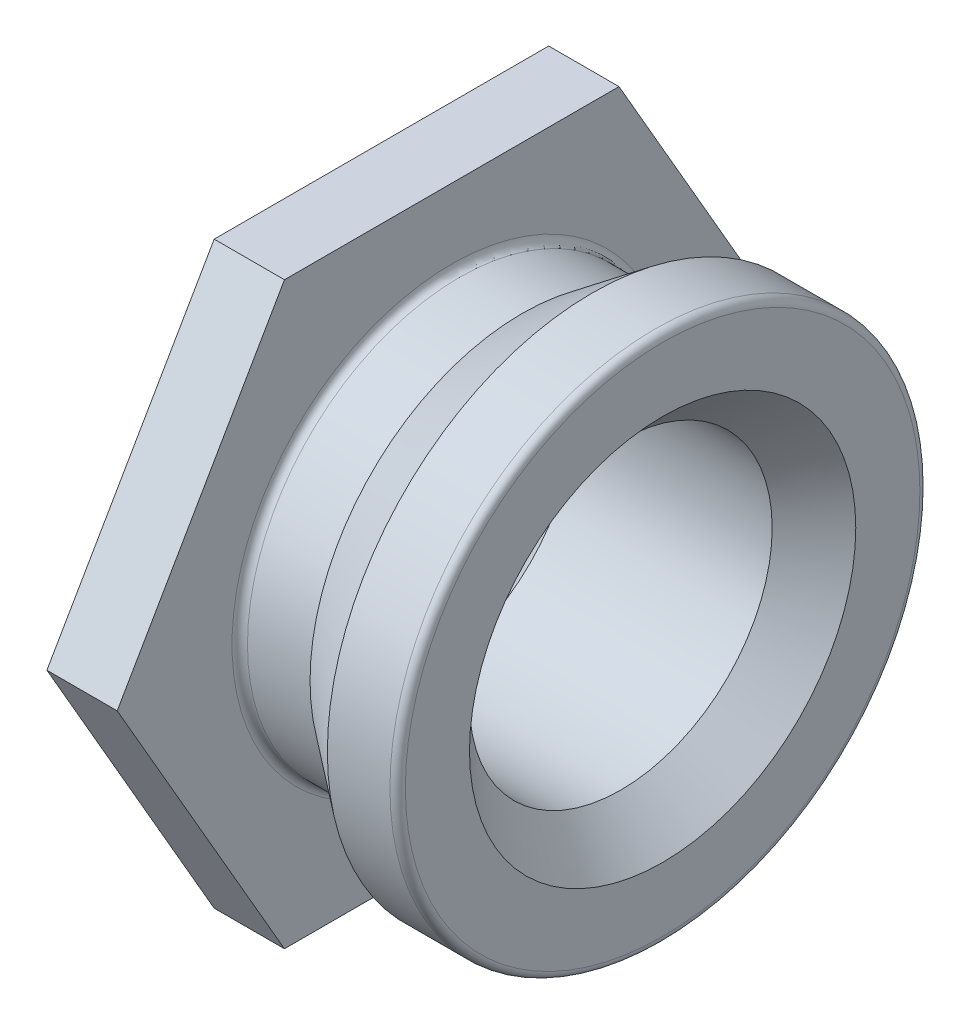
ISO-10303-21;
HEADER;
FILE_DESCRIPTION(('STEP AP214'),'2;1');
FILE_NAME('part.step','',(''),(''),'','','');
FILE_SCHEMA(('AUTOMOTIVE_DESIGN { 1 0 10303 214 1 1 1 1 }'));
ENDSEC;
DATA;
#1=APPLICATION_CONTEXT('core data for automotive mechanical design processes');
#2=APPLICATION_PROTOCOL_DEFINITION('international standard','automotive_design',2000,#1);
#3=PRODUCT_CONTEXT('',#1,'mechanical');
#4=PRODUCT('Part','Part','',(#3));
#5=PRODUCT_RELATED_PRODUCT_CATEGORY('part','',(#4));
#6=PRODUCT_DEFINITION_FORMATION('','',#4);
#7=PRODUCT_DEFINITION_CONTEXT('part definition',#1,'design');
#8=PRODUCT_DEFINITION('design','',#6,#7);
#9=PRODUCT_DEFINITION_SHAPE('','',#8);
#10=(LENGTH_UNIT() NAMED_UNIT(*) SI_UNIT(.MILLI.,.METRE.));
#11=(NAMED_UNIT(*) PLANE_ANGLE_UNIT() SI_UNIT($,.RADIAN.));
#12=(NAMED_UNIT(*) SI_UNIT($,.STERADIAN.) SOLID_ANGLE_UNIT());
#13=UNCERTAINTY_MEASURE_WITH_UNIT(LENGTH_MEASURE(1.E-05),#10,'distance_accuracy_value','');
#14=(GEOMETRIC_REPRESENTATION_CONTEXT(3) GLOBAL_UNCERTAINTY_ASSIGNED_CONTEXT((#13)) GLOBAL_UNIT_ASSIGNED_CONTEXT((#10,
#11,#12)) REPRESENTATION_CONTEXT('',''));
#15=CARTESIAN_POINT('',(0.,0.,0.));
#16=DIRECTION('',(0.,0.,1.));
#17=DIRECTION('',(1.,0.,0.));
#18=AXIS2_PLACEMENT_3D('',#15,#16,#17);
#19=CARTESIAN_POINT('',(-2.82575,0.,0.));
#20=DIRECTION('',(1.,0.,0.));
#21=DIRECTION('',(0.,0.,-1.));
#22=AXIS2_PLACEMENT_3D('',#19,#20,#21);
#23=CYLINDRICAL_SURFACE('',#22,3.48488);
#24=CARTESIAN_POINT('',(-3.3401,0.,0.));
#25=DIRECTION('',(1.,0.,0.));
#26=DIRECTION('',(0.,0.,-1.));
#27=AXIS2_PLACEMENT_3D('',#24,#25,#26);
#28=CIRCLE('',#27,3.48488);
#29=CARTESIAN_POINT('',(-3.3401,0.,-3.48488));
#30=VERTEX_POINT('',#29);
#31=EDGE_CURVE('E134',#30,#30,#28,.T.);
#32=ORIENTED_EDGE('',*,*,#31,.T.);
#33=EDGE_LOOP('',(#32));
#34=FACE_BOUND('',#33,.T.);
#35=CARTESIAN_POINT('',(-2.31140000033747,0.,0.));
#36=DIRECTION('',(1.,0.,0.));
#37=DIRECTION('',(0.,0.,1.));
#38=AXIS2_PLACEMENT_3D('',#35,#36,#37);
#39=CIRCLE('',#38,3.48488000042835);
#40=CARTESIAN_POINT('',(-2.31140000033747,0.,3.48488000042835));
#41=VERTEX_POINT('',#40);
#42=EDGE_CURVE('E152',#41,#41,#39,.T.);
#43=ORIENTED_EDGE('',*,*,#42,.F.);
#44=EDGE_LOOP('',(#43));
#45=FACE_BOUND('',#44,.T.);
#46=ADVANCED_FACE('F16',(#34,#45),#23,.T.);
#47=CARTESIAN_POINT('',(-1.15569999979925,0.,0.));
#48=DIRECTION('',(1.,0.,0.));
#49=DIRECTION('',(0.,0.,-1.));
#50=AXIS2_PLACEMENT_3D('',#47,#48,#49);
#51=CONICAL_SURFACE('',#50,4.35609999948383,0.645958105561131);
#52=ORIENTED_EDGE('',*,*,#42,.T.);
#53=EDGE_LOOP('',(#52));
#54=FACE_BOUND('',#53,.T.);
#55=CARTESIAN_POINT('',(-1.1557,0.,0.));
#56=DIRECTION('',(1.,0.,0.));
#57=DIRECTION('',(0.,0.,-1.));
#58=AXIS2_PLACEMENT_3D('',#55,#56,#57);
#59=CIRCLE('',#58,4.3561);
#60=CARTESIAN_POINT('',(-1.1557,0.,-4.3561));
#61=VERTEX_POINT('',#60);
#62=EDGE_CURVE('E126',#61,#61,#59,.T.);
#63=ORIENTED_EDGE('',*,*,#62,.F.);
#64=EDGE_LOOP('',(#63));
#65=FACE_BOUND('',#64,.T.);
#66=ADVANCED_FACE('F145',(#54,#65),#51,.T.);
#67=CARTESIAN_POINT('',(-3.3401,0.,0.));
#68=DIRECTION('',(1.,0.,0.));
#69=DIRECTION('',(0.,0.,-1.));
#70=AXIS2_PLACEMENT_3D('',#67,#68,#69);
#71=TOROIDAL_SURFACE('',#70,3.61188,0.126999999999999);
#72=CARTESIAN_POINT('',(-3.4671,0.,0.));
#73=DIRECTION('',(1.,0.,0.));
#74=DIRECTION('',(0.,0.,-1.));
#75=AXIS2_PLACEMENT_3D('',#72,#73,#74);
#76=CIRCLE('',#75,3.61188);
#77=CARTESIAN_POINT('',(-3.4671,0.,-3.61188));
#78=VERTEX_POINT('',#77);
#79=EDGE_CURVE('E122',#78,#78,#76,.F.);
#80=ORIENTED_EDGE('',*,*,#79,.F.);
#81=EDGE_LOOP('',(#80));
#82=FACE_BOUND('',#81,.T.);
#83=ORIENTED_EDGE('',*,*,#31,.F.);
#84=EDGE_LOOP('',(#83));
#85=FACE_BOUND('',#84,.T.);
#86=ADVANCED_FACE('F141',(#82,#85),#71,.F.);
#87=CARTESIAN_POINT('',(-0.64135,0.,0.));
#88=DIRECTION('',(1.,0.,0.));
#89=DIRECTION('',(0.,0.,-1.));
#90=AXIS2_PLACEMENT_3D('',#87,#88,#89);
#91=CYLINDRICAL_SURFACE('',#90,4.3561);
#92=ORIENTED_EDGE('',*,*,#62,.T.);
#93=EDGE_LOOP('',(#92));
#94=FACE_BOUND('',#93,.T.);
#95=CARTESIAN_POINT('',(-0.127,0.,0.));
#96=DIRECTION('',(1.,0.,0.));
#97=DIRECTION('',(0.,0.,-1.));
#98=AXIS2_PLACEMENT_3D('',#95,#96,#97);
#99=CIRCLE('',#98,4.3561);
#100=CARTESIAN_POINT('',(-0.127,0.,-4.3561));
#101=VERTEX_POINT('',#100);
#102=EDGE_CURVE('E82',#101,#101,#99,.T.);
#103=ORIENTED_EDGE('',*,*,#102,.F.);
#104=EDGE_LOOP('',(#103));
#105=FACE_BOUND('',#104,.T.);
#106=ADVANCED_FACE('F144',(#94,#105),#91,.T.);
#107=CARTESIAN_POINT('',(-3.4671,0.,0.));
#108=DIRECTION('',(1.,0.,0.));
#109=DIRECTION('',(0.,0.,-1.));
#110=AXIS2_PLACEMENT_3D('',#107,#108,#109);
#111=PLANE('',#110);
#112=ORIENTED_EDGE('',*,*,#79,.T.);
#113=EDGE_LOOP('',(#112));
#114=FACE_BOUND('',#113,.T.);
#115=DIRECTION('',(0.,0.866025403784438,-0.5));
#116=VECTOR('',#115,1.);
#117=CARTESIAN_POINT('',(-3.4671,0.,-5.49926131403119));
#118=LINE('',#117,#116);
#119=CARTESIAN_POINT('',(-3.4671,0.,-5.49926131403119));
#120=VERTEX_POINT('',#119);
#121=CARTESIAN_POINT('',(-3.4671,-4.7625,-2.74963065701559));
#122=VERTEX_POINT('',#121);
#123=EDGE_CURVE('E86',#120,#122,#118,.F.);
#124=ORIENTED_EDGE('',*,*,#123,.F.);
#125=DIRECTION('',(0.,0.866025403784439,0.5));
#126=VECTOR('',#125,1.);
#127=CARTESIAN_POINT('',(-3.4671,4.7625,-2.7496306570156));
#128=LINE('',#127,#126);
#129=CARTESIAN_POINT('',(-3.4671,4.7625,-2.7496306570156));
#130=VERTEX_POINT('',#129);
#131=EDGE_CURVE('E67',#130,#120,#128,.F.);
#132=ORIENTED_EDGE('',*,*,#131,.F.);
#133=DIRECTION('',(0.,0.,1.));
#134=VECTOR('',#133,1.);
#135=CARTESIAN_POINT('',(-3.4671,4.7625,0.));
#136=LINE('',#135,#134);
#137=CARTESIAN_POINT('',(-3.4671,4.7625,2.74963065701559));
#138=VERTEX_POINT('',#137);
#139=EDGE_CURVE('E74',#138,#130,#136,.F.);
#140=ORIENTED_EDGE('',*,*,#139,.F.);
#141=DIRECTION('',(0.,-0.866025403784439,0.5));
#142=VECTOR('',#141,1.);
#143=CARTESIAN_POINT('',(-3.4671,0.,5.49926131403118));
#144=LINE('',#143,#142);
#145=CARTESIAN_POINT('',(-3.4671,0.,5.49926131403118));
#146=VERTEX_POINT('',#145);
#147=EDGE_CURVE('E451',#146,#138,#144,.F.);
#148=ORIENTED_EDGE('',*,*,#147,.F.);
#149=DIRECTION('',(0.,-0.866025403784439,-0.5));
#150=VECTOR('',#149,1.);
#151=CARTESIAN_POINT('',(-3.4671,-4.7625,2.74963065701559));
#152=LINE('',#151,#150);
#153=CARTESIAN_POINT('',(-3.4671,-4.7625,2.74963065701559));
#154=VERTEX_POINT('',#153);
#155=EDGE_CURVE('E446',#154,#146,#152,.F.);
#156=ORIENTED_EDGE('',*,*,#155,.F.);
#157=DIRECTION('',(0.,0.,-1.));
#158=VECTOR('',#157,1.);
#159=CARTESIAN_POINT('',(-3.4671,-4.7625,-2.74963065701559));
#160=LINE('',#159,#158);
#161=EDGE_CURVE('E441',#122,#154,#160,.F.);
#162=ORIENTED_EDGE('',*,*,#161,.F.);
#163=EDGE_LOOP('',(#124,#132,#140,#148,#156,#162));
#164=FACE_BOUND('',#163,.T.);
#165=ADVANCED_FACE('F89',(#114,#164),#111,.T.);
#166=CARTESIAN_POINT('',(-0.127,0.,0.));
#167=DIRECTION('',(1.,0.,0.));
#168=DIRECTION('',(0.,0.,-1.));
#169=AXIS2_PLACEMENT_3D('',#166,#167,#168);
#170=TOROIDAL_SURFACE('',#169,4.2291,0.127);
#171=CARTESIAN_POINT('',(0.,0.,0.));
#172=DIRECTION('',(-1.,0.,0.));
#173=DIRECTION('',(0.,0.,1.));
#174=AXIS2_PLACEMENT_3D('',#171,#172,#173);
#175=CIRCLE('',#174,4.2291);
#176=CARTESIAN_POINT('',(0.,0.,4.2291));
#177=VERTEX_POINT('',#176);
#178=EDGE_CURVE('E184',#177,#177,#175,.F.);
#179=ORIENTED_EDGE('',*,*,#178,.F.);
#180=EDGE_LOOP('',(#179));
#181=FACE_BOUND('',#180,.T.);
#182=ORIENTED_EDGE('',*,*,#102,.T.);
#183=EDGE_LOOP('',(#182));
#184=FACE_BOUND('',#183,.T.);
#185=ADVANCED_FACE('F98',(#181,#184),#170,.T.);
#186=CARTESIAN_POINT('',(-4.6228,4.7625,0.));
#187=DIRECTION('',(0.,1.,0.));
#188=DIRECTION('',(0.,0.,1.));
#189=AXIS2_PLACEMENT_3D('',#186,#187,#188);
#190=PLANE('',#189);
#191=DIRECTION('',(0.,0.,1.));
#192=VECTOR('',#191,1.);
#193=CARTESIAN_POINT('',(-4.6228,4.7625,1.80594));
#194=LINE('',#193,#192);
#195=CARTESIAN_POINT('',(-4.6228,4.7625,2.74963065701559));
#196=VERTEX_POINT('',#195);
#197=CARTESIAN_POINT('',(-4.6228,4.7625,-2.7496306570156));
#198=VERTEX_POINT('',#197);
#199=EDGE_CURVE('E182',#196,#198,#194,.F.);
#200=ORIENTED_EDGE('',*,*,#199,.F.);
#201=DIRECTION('',(1.,0.,0.));
#202=VECTOR('',#201,1.);
#203=CARTESIAN_POINT('',(-4.6228,4.7625,2.74963065701559));
#204=LINE('',#203,#202);
#205=EDGE_CURVE('E79',#138,#196,#204,.F.);
#206=ORIENTED_EDGE('',*,*,#205,.F.);
#207=ORIENTED_EDGE('',*,*,#139,.T.);
#208=DIRECTION('',(1.,0.,0.));
#209=VECTOR('',#208,1.);
#210=CARTESIAN_POINT('',(-4.6228,4.7625,-2.7496306570156));
#211=LINE('',#210,#209);
#212=EDGE_CURVE('E77',#198,#130,#211,.T.);
#213=ORIENTED_EDGE('',*,*,#212,.F.);
#214=EDGE_LOOP('',(#200,#206,#207,#213));
#215=FACE_BOUND('',#214,.T.);
#216=ADVANCED_FACE('F76',(#215),#190,.T.);
#217=CARTESIAN_POINT('',(-4.6228,4.7625,-2.7496306570156));
#218=DIRECTION('',(0.,0.5,-0.866025403784439));
#219=DIRECTION('',(0.,0.866025403784439,0.5));
#220=AXIS2_PLACEMENT_3D('',#217,#218,#219);
#221=PLANE('',#220);
#222=DIRECTION('',(0.,-0.866025403784439,-0.499999999999999));
#223=VECTOR('',#222,1.);
#224=CARTESIAN_POINT('',(-4.6228,4.7625,-2.7496306570156));
#225=LINE('',#224,#223);
#226=CARTESIAN_POINT('',(-4.6228,0.,-5.49926131403119));
#227=VERTEX_POINT('',#226);
#228=EDGE_CURVE('E85',#198,#227,#225,.T.);
#229=ORIENTED_EDGE('',*,*,#228,.F.);
#230=ORIENTED_EDGE('',*,*,#212,.T.);
#231=ORIENTED_EDGE('',*,*,#131,.T.);
#232=DIRECTION('',(1.,0.,0.));
#233=VECTOR('',#232,1.);
#234=CARTESIAN_POINT('',(-4.6228,0.,-5.49926131403119));
#235=LINE('',#234,#233);
#236=EDGE_CURVE('E436',#227,#120,#235,.T.);
#237=ORIENTED_EDGE('',*,*,#236,.F.);
#238=EDGE_LOOP('',(#229,#230,#231,#237));
#239=FACE_BOUND('',#238,.T.);
#240=ADVANCED_FACE('F84',(#239),#221,.T.);
#241=CARTESIAN_POINT('',(-4.6228,0.,-5.49926131403119));
#242=DIRECTION('',(0.,-0.5,-0.866025403784438));
#243=DIRECTION('',(0.,0.866025403784438,-0.5));
#244=AXIS2_PLACEMENT_3D('',#241,#242,#243);
#245=PLANE('',#244);
#246=DIRECTION('',(0.,-0.866025403784438,0.500000000000001));
#247=VECTOR('',#246,1.);
#248=CARTESIAN_POINT('',(-4.6228,0.,-5.49926131403119));
#249=LINE('',#248,#247);
#250=CARTESIAN_POINT('',(-4.6228,-4.7625,-2.74963065701559));
#251=VERTEX_POINT('',#250);
#252=EDGE_CURVE('E179',#227,#251,#249,.T.);
#253=ORIENTED_EDGE('',*,*,#252,.F.);
#254=ORIENTED_EDGE('',*,*,#236,.T.);
#255=ORIENTED_EDGE('',*,*,#123,.T.);
#256=DIRECTION('',(1.,0.,0.));
#257=VECTOR('',#256,1.);
#258=CARTESIAN_POINT('',(-4.6228,-4.7625,-2.74963065701559));
#259=LINE('',#258,#257);
#260=EDGE_CURVE('E438',#251,#122,#259,.T.);
#261=ORIENTED_EDGE('',*,*,#260,.F.);
#262=EDGE_LOOP('',(#253,#254,#255,#261));
#263=FACE_BOUND('',#262,.T.);
#264=ADVANCED_FACE('F217',(#263),#245,.T.);
#265=CARTESIAN_POINT('',(-4.6228,-4.7625,-2.74963065701559));
#266=DIRECTION('',(0.,-1.,0.));
#267=DIRECTION('',(0.,0.,-1.));
#268=AXIS2_PLACEMENT_3D('',#265,#266,#267);
#269=PLANE('',#268);
#270=DIRECTION('',(0.,0.,1.));
#271=VECTOR('',#270,1.);
#272=CARTESIAN_POINT('',(-4.6228,-4.7625,1.80594));
#273=LINE('',#272,#271);
#274=CARTESIAN_POINT('',(-4.6228,-4.7625,2.74963065701559));
#275=VERTEX_POINT('',#274);
#276=EDGE_CURVE('E173',#251,#275,#273,.T.);
#277=ORIENTED_EDGE('',*,*,#276,.F.);
#278=ORIENTED_EDGE('',*,*,#260,.T.);
#279=ORIENTED_EDGE('',*,*,#161,.T.);
#280=DIRECTION('',(1.,0.,0.));
#281=VECTOR('',#280,1.);
#282=CARTESIAN_POINT('',(-4.6228,-4.7625,2.74963065701559));
#283=LINE('',#282,#281);
#284=EDGE_CURVE('E448',#275,#154,#283,.T.);
#285=ORIENTED_EDGE('',*,*,#284,.F.);
#286=EDGE_LOOP('',(#277,#278,#279,#285));
#287=FACE_BOUND('',#286,.T.);
#288=ADVANCED_FACE('F213',(#287),#269,.T.);
#289=CARTESIAN_POINT('',(-4.6228,-4.7625,2.74963065701559));
#290=DIRECTION('',(0.,-0.5,0.866025403784439));
#291=DIRECTION('',(0.,-0.866025403784439,-0.5));
#292=AXIS2_PLACEMENT_3D('',#289,#290,#291);
#293=PLANE('',#292);
#294=DIRECTION('',(0.,0.866025403784439,0.499999999999999));
#295=VECTOR('',#294,1.);
#296=CARTESIAN_POINT('',(-4.6228,-4.7625,2.74963065701559));
#297=LINE('',#296,#295);
#298=CARTESIAN_POINT('',(-4.6228,0.,5.49926131403118));
#299=VERTEX_POINT('',#298);
#300=EDGE_CURVE('E34',#275,#299,#297,.T.);
#301=ORIENTED_EDGE('',*,*,#300,.F.);
#302=ORIENTED_EDGE('',*,*,#284,.T.);
#303=ORIENTED_EDGE('',*,*,#155,.T.);
#304=DIRECTION('',(1.,0.,0.));
#305=VECTOR('',#304,1.);
#306=CARTESIAN_POINT('',(-4.6228,0.,5.49926131403118));
#307=LINE('',#306,#305);
#308=EDGE_CURVE('E192',#299,#146,#307,.T.);
#309=ORIENTED_EDGE('',*,*,#308,.F.);
#310=EDGE_LOOP('',(#301,#302,#303,#309));
#311=FACE_BOUND('',#310,.T.);
#312=ADVANCED_FACE('F209',(#311),#293,.T.);
#313=CARTESIAN_POINT('',(-4.6228,0.,5.49926131403118));
#314=DIRECTION('',(0.,0.5,0.866025403784439));
#315=DIRECTION('',(0.,-0.866025403784439,0.5));
#316=AXIS2_PLACEMENT_3D('',#313,#314,#315);
#317=PLANE('',#316);
#318=DIRECTION('',(0.,0.866025403784439,-0.5));
#319=VECTOR('',#318,1.);
#320=CARTESIAN_POINT('',(-4.6228,0.,5.49926131403118));
#321=LINE('',#320,#319);
#322=EDGE_CURVE('E168',#299,#196,#321,.T.);
#323=ORIENTED_EDGE('',*,*,#322,.F.);
#324=ORIENTED_EDGE('',*,*,#308,.T.);
#325=ORIENTED_EDGE('',*,*,#147,.T.);
#326=ORIENTED_EDGE('',*,*,#205,.T.);
#327=EDGE_LOOP('',(#323,#324,#325,#326));
#328=FACE_BOUND('',#327,.T.);
#329=ADVANCED_FACE('F205',(#328),#317,.T.);
#330=CARTESIAN_POINT('',(0.,0.,2.11455));
#331=DIRECTION('',(1.,0.,0.));
#332=DIRECTION('',(0.,0.,-1.));
#333=AXIS2_PLACEMENT_3D('',#330,#331,#332);
#334=PLANE('',#333);
#335=CARTESIAN_POINT('',(2.8421709430404E-10,0.,0.));
#336=DIRECTION('',(1.,0.,0.));
#337=DIRECTION('',(0.,0.,-1.));
#338=AXIS2_PLACEMENT_3D('',#335,#336,#337);
#339=CIRCLE('',#338,3.17499999965776);
#340=CARTESIAN_POINT('',(2.8421709430404E-10,0.,-3.17499999965776));
#341=VERTEX_POINT('',#340);
#342=EDGE_CURVE('E19',#341,#341,#339,.F.);
#343=ORIENTED_EDGE('',*,*,#342,.T.);
#344=EDGE_LOOP('',(#343));
#345=FACE_BOUND('',#344,.T.);
#346=ORIENTED_EDGE('',*,*,#178,.T.);
#347=EDGE_LOOP('',(#346));
#348=FACE_BOUND('',#347,.T.);
#349=ADVANCED_FACE('F194',(#345,#348),#334,.T.);
#350=CARTESIAN_POINT('',(-4.6228,0.,1.80594));
#351=DIRECTION('',(-1.,0.,0.));
#352=DIRECTION('',(0.,0.,1.));
#353=AXIS2_PLACEMENT_3D('',#350,#351,#352);
#354=PLANE('',#353);
#355=CARTESIAN_POINT('',(-4.62280000027704,0.,0.));
#356=DIRECTION('',(-1.,0.,0.));
#357=DIRECTION('',(0.,0.,1.));
#358=AXIS2_PLACEMENT_3D('',#355,#356,#357);
#359=CIRCLE('',#358,3.17499999965776);
#360=CARTESIAN_POINT('',(-4.62280000027704,0.,3.17499999965776));
#361=VERTEX_POINT('',#360);
#362=EDGE_CURVE('E161',#361,#361,#359,.F.);
#363=ORIENTED_EDGE('',*,*,#362,.T.);
#364=EDGE_LOOP('',(#363));
#365=FACE_BOUND('',#364,.T.);
#366=ORIENTED_EDGE('',*,*,#300,.T.);
#367=ORIENTED_EDGE('',*,*,#322,.T.);
#368=ORIENTED_EDGE('',*,*,#199,.T.);
#369=ORIENTED_EDGE('',*,*,#228,.T.);
#370=ORIENTED_EDGE('',*,*,#252,.T.);
#371=ORIENTED_EDGE('',*,*,#276,.T.);
#372=EDGE_LOOP('',(#366,#367,#368,#369,#370,#371));
#373=FACE_BOUND('',#372,.T.);
#374=ADVANCED_FACE('F204',(#365,#373),#354,.T.);
#375=CARTESIAN_POINT('',(2.8421709430404E-10,0.,0.));
#376=DIRECTION('',(1.,0.,0.));
#377=DIRECTION('',(0.,0.,-1.));
#378=AXIS2_PLACEMENT_3D('',#375,#376,#377);
#379=CONICAL_SURFACE('',#378,3.17499999965776,0.785398162487384);
#380=CARTESIAN_POINT('',(-0.68707,0.,0.));
#381=DIRECTION('',(1.,0.,0.));
#382=DIRECTION('',(0.,0.,-1.));
#383=AXIS2_PLACEMENT_3D('',#380,#381,#382);
#384=CIRCLE('',#383,2.48793);
#385=CARTESIAN_POINT('',(-0.68707,0.,-2.48793));
#386=VERTEX_POINT('',#385);
#387=EDGE_CURVE('E25',#386,#386,#384,.F.);
#388=ORIENTED_EDGE('',*,*,#387,.T.);
#389=EDGE_LOOP('',(#388));
#390=FACE_BOUND('',#389,.T.);
#391=ORIENTED_EDGE('',*,*,#342,.F.);
#392=EDGE_LOOP('',(#391));
#393=FACE_BOUND('',#392,.T.);
#394=ADVANCED_FACE('F234',(#390,#393),#379,.F.);
#395=CARTESIAN_POINT('',(-4.62280000027704,0.,0.));
#396=DIRECTION('',(-1.,0.,0.));
#397=DIRECTION('',(0.,0.,1.));
#398=AXIS2_PLACEMENT_3D('',#395,#396,#397);
#399=CONICAL_SURFACE('',#398,3.17499999965776,0.785398162487384);
#400=ORIENTED_EDGE('',*,*,#362,.F.);
#401=EDGE_LOOP('',(#400));
#402=FACE_BOUND('',#401,.T.);
#403=CARTESIAN_POINT('',(-3.93573,0.,0.));
#404=DIRECTION('',(1.,0.,0.));
#405=DIRECTION('',(0.,0.,-1.));
#406=AXIS2_PLACEMENT_3D('',#403,#404,#405);
#407=CIRCLE('',#406,2.48793);
#408=CARTESIAN_POINT('',(-3.93573,0.,-2.48793));
#409=VERTEX_POINT('',#408);
#410=EDGE_CURVE('E10',#409,#409,#407,.T.);
#411=ORIENTED_EDGE('',*,*,#410,.T.);
#412=EDGE_LOOP('',(#411));
#413=FACE_BOUND('',#412,.T.);
#414=ADVANCED_FACE('F228',(#402,#413),#399,.F.);
#415=CARTESIAN_POINT('',(-2.3114,0.,0.));
#416=DIRECTION('',(1.,0.,0.));
#417=DIRECTION('',(0.,0.,-1.));
#418=AXIS2_PLACEMENT_3D('',#415,#416,#417);
#419=CYLINDRICAL_SURFACE('',#418,2.48793);
#420=ORIENTED_EDGE('',*,*,#410,.F.);
#421=EDGE_LOOP('',(#420));
#422=FACE_BOUND('',#421,.T.);
#423=ORIENTED_EDGE('',*,*,#387,.F.);
#424=EDGE_LOOP('',(#423));
#425=FACE_BOUND('',#424,.T.);
#426=ADVANCED_FACE('F226',(#422,#425),#419,.F.);
#427=CLOSED_SHELL('',(#46,#66,#86,#106,#165,#185,#216,#240,#264,#288,#312,#329,#349,#374,#394,
#414,#426));
#428=MANIFOLD_SOLID_BREP('B1',#427);
#429=ADVANCED_BREP_SHAPE_REPRESENTATION('',(#18,#428),#14);
#430=SHAPE_DEFINITION_REPRESENTATION(#9,#429);
ENDSEC;
END-ISO-10303-21;
